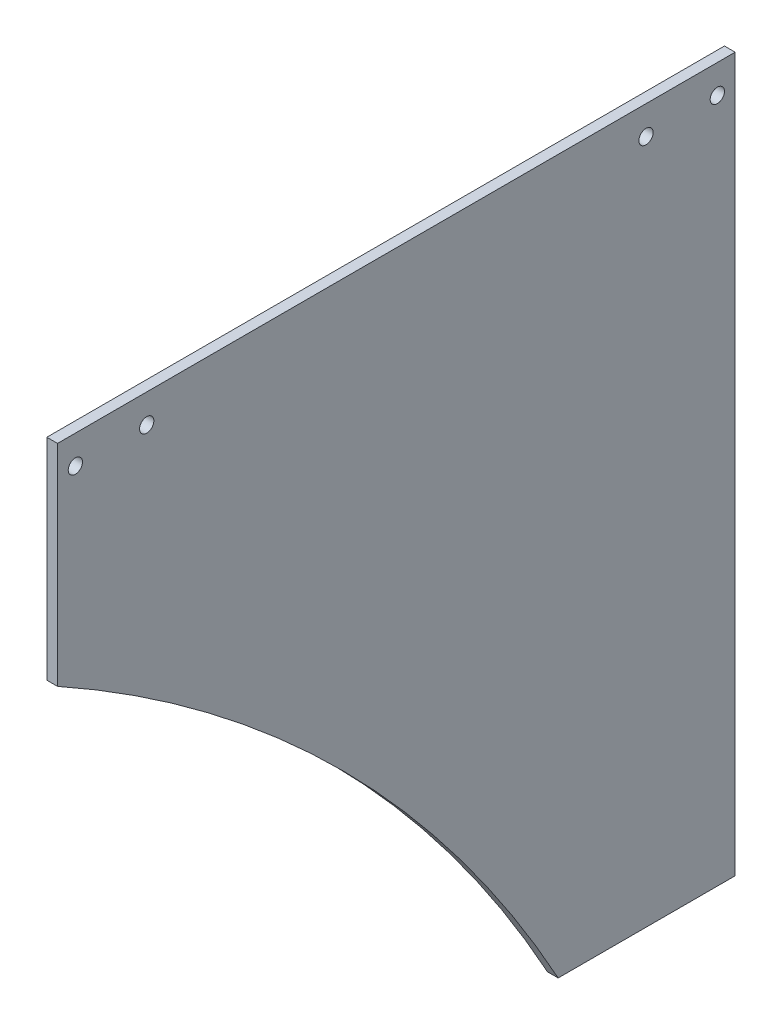
ISO-10303-21;
HEADER;
FILE_DESCRIPTION(('STEP AP214'),'2;1');
FILE_NAME('part.step','',(''),(''),'','','');
FILE_SCHEMA(('AUTOMOTIVE_DESIGN { 1 0 10303 214 1 1 1 1 }'));
ENDSEC;
DATA;
#1=APPLICATION_CONTEXT('core data for automotive mechanical design processes');
#2=APPLICATION_PROTOCOL_DEFINITION('international standard','automotive_design',2000,#1);
#3=PRODUCT_CONTEXT('',#1,'mechanical');
#4=PRODUCT('Part','Part','',(#3));
#5=PRODUCT_RELATED_PRODUCT_CATEGORY('part','',(#4));
#6=PRODUCT_DEFINITION_FORMATION('','',#4);
#7=PRODUCT_DEFINITION_CONTEXT('part definition',#1,'design');
#8=PRODUCT_DEFINITION('design','',#6,#7);
#9=PRODUCT_DEFINITION_SHAPE('','',#8);
#10=(LENGTH_UNIT() NAMED_UNIT(*) SI_UNIT(.MILLI.,.METRE.));
#11=(NAMED_UNIT(*) PLANE_ANGLE_UNIT() SI_UNIT($,.RADIAN.));
#12=(NAMED_UNIT(*) SI_UNIT($,.STERADIAN.) SOLID_ANGLE_UNIT());
#13=UNCERTAINTY_MEASURE_WITH_UNIT(LENGTH_MEASURE(1.E-05),#10,'distance_accuracy_value','');
#14=(GEOMETRIC_REPRESENTATION_CONTEXT(3) GLOBAL_UNCERTAINTY_ASSIGNED_CONTEXT((#13)) GLOBAL_UNIT_ASSIGNED_CONTEXT((#10,
#11,#12)) REPRESENTATION_CONTEXT('',''));
#15=CARTESIAN_POINT('',(0.,0.,0.));
#16=DIRECTION('',(0.,0.,1.));
#17=DIRECTION('',(1.,0.,0.));
#18=AXIS2_PLACEMENT_3D('',#15,#16,#17);
#19=CARTESIAN_POINT('',(-3.,0.,0.));
#20=DIRECTION('',(0.,0.,-1.));
#21=DIRECTION('',(-1.,0.,0.));
#22=AXIS2_PLACEMENT_3D('',#19,#20,#21);
#23=PLANE('',#22);
#24=DIRECTION('',(0.,1.,0.));
#25=VECTOR('',#24,1.);
#26=CARTESIAN_POINT('',(0.,0.,0.));
#27=LINE('',#26,#25);
#28=CARTESIAN_POINT('',(0.,0.,0.));
#29=VERTEX_POINT('',#28);
#30=CARTESIAN_POINT('',(0.,200.,0.));
#31=VERTEX_POINT('',#30);
#32=EDGE_CURVE('E116',#29,#31,#27,.T.);
#33=ORIENTED_EDGE('',*,*,#32,.F.);
#34=DIRECTION('',(1.,0.,0.));
#35=VECTOR('',#34,1.);
#36=CARTESIAN_POINT('',(-3.,0.,0.));
#37=LINE('',#36,#35);
#38=CARTESIAN_POINT('',(-3.,0.,0.));
#39=VERTEX_POINT('',#38);
#40=EDGE_CURVE('E11',#39,#29,#37,.T.);
#41=ORIENTED_EDGE('',*,*,#40,.F.);
#42=DIRECTION('',(0.,1.,0.));
#43=VECTOR('',#42,1.);
#44=CARTESIAN_POINT('',(-3.,0.,0.));
#45=LINE('',#44,#43);
#46=CARTESIAN_POINT('',(-3.,200.,0.));
#47=VERTEX_POINT('',#46);
#48=EDGE_CURVE('E111',#39,#47,#45,.T.);
#49=ORIENTED_EDGE('',*,*,#48,.T.);
#50=DIRECTION('',(1.,0.,0.));
#51=VECTOR('',#50,1.);
#52=CARTESIAN_POINT('',(-3.,200.,0.));
#53=LINE('',#52,#51);
#54=EDGE_CURVE('E42',#47,#31,#53,.T.);
#55=ORIENTED_EDGE('',*,*,#54,.T.);
#56=EDGE_LOOP('',(#33,#41,#49,#55));
#57=FACE_BOUND('',#56,.T.);
#58=ADVANCED_FACE('F39',(#57),#23,.T.);
#59=CARTESIAN_POINT('',(-3.,0.,49.6239947896954));
#60=DIRECTION('',(0.,-1.,0.));
#61=DIRECTION('',(0.,0.,-1.));
#62=AXIS2_PLACEMENT_3D('',#59,#60,#61);
#63=PLANE('',#62);
#64=DIRECTION('',(0.,0.,-1.));
#65=VECTOR('',#64,1.);
#66=CARTESIAN_POINT('',(0.,0.,49.6239947896954));
#67=LINE('',#66,#65);
#68=CARTESIAN_POINT('',(0.,0.,49.6239947896954));
#69=VERTEX_POINT('',#68);
#70=EDGE_CURVE('E126',#69,#29,#67,.T.);
#71=ORIENTED_EDGE('',*,*,#70,.F.);
#72=DIRECTION('',(1.,0.,0.));
#73=VECTOR('',#72,1.);
#74=CARTESIAN_POINT('',(-3.,0.,49.6239947896954));
#75=LINE('',#74,#73);
#76=CARTESIAN_POINT('',(-3.,0.,49.6239947896954));
#77=VERTEX_POINT('',#76);
#78=EDGE_CURVE('E48',#77,#69,#75,.T.);
#79=ORIENTED_EDGE('',*,*,#78,.F.);
#80=DIRECTION('',(0.,0.,-1.));
#81=VECTOR('',#80,1.);
#82=CARTESIAN_POINT('',(-3.,0.,49.6239947896954));
#83=LINE('',#82,#81);
#84=EDGE_CURVE('E106',#77,#39,#83,.T.);
#85=ORIENTED_EDGE('',*,*,#84,.T.);
#86=ORIENTED_EDGE('',*,*,#40,.T.);
#87=EDGE_LOOP('',(#71,#79,#85,#86));
#88=FACE_BOUND('',#87,.T.);
#89=ADVANCED_FACE('F132',(#88),#63,.T.);
#90=CARTESIAN_POINT('',(-3.,-173.602924334787,365.));
#91=DIRECTION('',(1.,0.,0.));
#92=DIRECTION('',(0.,0.,-1.));
#93=AXIS2_PLACEMENT_3D('',#90,#91,#92);
#94=CYLINDRICAL_SURFACE('',#93,360.);
#95=CARTESIAN_POINT('',(0.,-173.602924334787,365.));
#96=DIRECTION('',(-1.,0.,0.));
#97=DIRECTION('',(0.,0.,-1.));
#98=AXIS2_PLACEMENT_3D('',#95,#96,#97);
#99=CIRCLE('',#98,360.);
#100=CARTESIAN_POINT('',(0.,141.,190.));
#101=VERTEX_POINT('',#100);
#102=EDGE_CURVE('E95',#101,#69,#99,.T.);
#103=ORIENTED_EDGE('',*,*,#102,.F.);
#104=DIRECTION('',(1.,0.,0.));
#105=VECTOR('',#104,1.);
#106=CARTESIAN_POINT('',(-3.,141.,190.));
#107=LINE('',#106,#105);
#108=CARTESIAN_POINT('',(-3.,141.,190.));
#109=VERTEX_POINT('',#108);
#110=EDGE_CURVE('E90',#109,#101,#107,.T.);
#111=ORIENTED_EDGE('',*,*,#110,.F.);
#112=CARTESIAN_POINT('',(-3.,-173.602924334787,365.));
#113=DIRECTION('',(-1.,0.,0.));
#114=DIRECTION('',(0.,0.,-1.));
#115=AXIS2_PLACEMENT_3D('',#112,#113,#114);
#116=CIRCLE('',#115,360.);
#117=EDGE_CURVE('E93',#109,#77,#116,.T.);
#118=ORIENTED_EDGE('',*,*,#117,.T.);
#119=ORIENTED_EDGE('',*,*,#78,.T.);
#120=EDGE_LOOP('',(#103,#111,#118,#119));
#121=FACE_BOUND('',#120,.T.);
#122=ADVANCED_FACE('F92',(#121),#94,.F.);
#123=CARTESIAN_POINT('',(-3.,141.,190.));
#124=DIRECTION('',(0.,0.,1.));
#125=DIRECTION('',(1.,0.,0.));
#126=AXIS2_PLACEMENT_3D('',#123,#124,#125);
#127=PLANE('',#126);
#128=DIRECTION('',(0.,-1.,0.));
#129=VECTOR('',#128,1.);
#130=CARTESIAN_POINT('',(0.,141.,190.));
#131=LINE('',#130,#129);
#132=CARTESIAN_POINT('',(0.,200.,190.));
#133=VERTEX_POINT('',#132);
#134=EDGE_CURVE('E123',#133,#101,#131,.T.);
#135=ORIENTED_EDGE('',*,*,#134,.F.);
#136=DIRECTION('',(1.,0.,0.));
#137=VECTOR('',#136,1.);
#138=CARTESIAN_POINT('',(-3.,200.,190.));
#139=LINE('',#138,#137);
#140=CARTESIAN_POINT('',(-3.,200.,190.));
#141=VERTEX_POINT('',#140);
#142=EDGE_CURVE('E100',#141,#133,#139,.T.);
#143=ORIENTED_EDGE('',*,*,#142,.F.);
#144=DIRECTION('',(0.,-1.,0.));
#145=VECTOR('',#144,1.);
#146=CARTESIAN_POINT('',(-3.,141.,190.));
#147=LINE('',#146,#145);
#148=EDGE_CURVE('E105',#141,#109,#147,.T.);
#149=ORIENTED_EDGE('',*,*,#148,.T.);
#150=ORIENTED_EDGE('',*,*,#110,.T.);
#151=EDGE_LOOP('',(#135,#143,#149,#150));
#152=FACE_BOUND('',#151,.T.);
#153=ADVANCED_FACE('F108',(#152),#127,.T.);
#154=CARTESIAN_POINT('',(-3.,200.,190.));
#155=DIRECTION('',(0.,1.,0.));
#156=DIRECTION('',(0.,0.,1.));
#157=AXIS2_PLACEMENT_3D('',#154,#155,#156);
#158=PLANE('',#157);
#159=DIRECTION('',(0.,0.,1.));
#160=VECTOR('',#159,1.);
#161=CARTESIAN_POINT('',(0.,200.,190.));
#162=LINE('',#161,#160);
#163=EDGE_CURVE('E119',#31,#133,#162,.T.);
#164=ORIENTED_EDGE('',*,*,#163,.F.);
#165=ORIENTED_EDGE('',*,*,#54,.F.);
#166=DIRECTION('',(0.,0.,1.));
#167=VECTOR('',#166,1.);
#168=CARTESIAN_POINT('',(-3.,200.,190.));
#169=LINE('',#168,#167);
#170=EDGE_CURVE('E109',#47,#141,#169,.T.);
#171=ORIENTED_EDGE('',*,*,#170,.T.);
#172=ORIENTED_EDGE('',*,*,#142,.T.);
#173=EDGE_LOOP('',(#164,#165,#171,#172));
#174=FACE_BOUND('',#173,.T.);
#175=ADVANCED_FACE('F129',(#174),#158,.T.);
#176=CARTESIAN_POINT('',(-3.,-173.602924334787,365.));
#177=DIRECTION('',(1.,0.,0.));
#178=DIRECTION('',(0.,0.,-1.));
#179=AXIS2_PLACEMENT_3D('',#176,#177,#178);
#180=PLANE('',#179);
#181=CARTESIAN_POINT('',(-3.,192.,5.));
#182=DIRECTION('',(1.,0.,0.));
#183=DIRECTION('',(0.,0.,-1.));
#184=AXIS2_PLACEMENT_3D('',#181,#182,#183);
#185=CIRCLE('',#184,2.);
#186=CARTESIAN_POINT('',(-3.,192.,3.));
#187=VERTEX_POINT('',#186);
#188=EDGE_CURVE('E175',#187,#187,#185,.T.);
#189=ORIENTED_EDGE('',*,*,#188,.T.);
#190=EDGE_LOOP('',(#189));
#191=FACE_BOUND('',#190,.T.);
#192=CARTESIAN_POINT('',(-3.,192.,25.));
#193=DIRECTION('',(1.,0.,0.));
#194=DIRECTION('',(0.,0.,-1.));
#195=AXIS2_PLACEMENT_3D('',#192,#193,#194);
#196=CIRCLE('',#195,2.);
#197=CARTESIAN_POINT('',(-3.,192.,23.));
#198=VERTEX_POINT('',#197);
#199=EDGE_CURVE('E183',#198,#198,#196,.T.);
#200=ORIENTED_EDGE('',*,*,#199,.T.);
#201=EDGE_LOOP('',(#200));
#202=FACE_BOUND('',#201,.T.);
#203=CARTESIAN_POINT('',(-3.,192.,165.));
#204=DIRECTION('',(1.,0.,0.));
#205=DIRECTION('',(0.,0.,-1.));
#206=AXIS2_PLACEMENT_3D('',#203,#204,#205);
#207=CIRCLE('',#206,2.);
#208=CARTESIAN_POINT('',(-3.,192.,163.));
#209=VERTEX_POINT('',#208);
#210=EDGE_CURVE('E189',#209,#209,#207,.T.);
#211=ORIENTED_EDGE('',*,*,#210,.T.);
#212=EDGE_LOOP('',(#211));
#213=FACE_BOUND('',#212,.T.);
#214=CARTESIAN_POINT('',(-3.,192.,185.));
#215=DIRECTION('',(1.,0.,0.));
#216=DIRECTION('',(0.,0.,-1.));
#217=AXIS2_PLACEMENT_3D('',#214,#215,#216);
#218=CIRCLE('',#217,2.);
#219=CARTESIAN_POINT('',(-3.,192.,183.));
#220=VERTEX_POINT('',#219);
#221=EDGE_CURVE('E120',#220,#220,#218,.T.);
#222=ORIENTED_EDGE('',*,*,#221,.T.);
#223=EDGE_LOOP('',(#222));
#224=FACE_BOUND('',#223,.T.);
#225=ORIENTED_EDGE('',*,*,#48,.F.);
#226=ORIENTED_EDGE('',*,*,#84,.F.);
#227=ORIENTED_EDGE('',*,*,#117,.F.);
#228=ORIENTED_EDGE('',*,*,#148,.F.);
#229=ORIENTED_EDGE('',*,*,#170,.F.);
#230=EDGE_LOOP('',(#225,#226,#227,#228,#229));
#231=FACE_BOUND('',#230,.T.);
#232=ADVANCED_FACE('F104',(#191,#202,#213,#224,#231),#180,.F.);
#233=CARTESIAN_POINT('',(0.,-173.602924334787,365.));
#234=DIRECTION('',(1.,0.,0.));
#235=DIRECTION('',(0.,0.,-1.));
#236=AXIS2_PLACEMENT_3D('',#233,#234,#235);
#237=PLANE('',#236);
#238=CARTESIAN_POINT('',(0.,192.,5.));
#239=DIRECTION('',(1.,0.,0.));
#240=DIRECTION('',(0.,0.,-1.));
#241=AXIS2_PLACEMENT_3D('',#238,#239,#240);
#242=CIRCLE('',#241,2.);
#243=CARTESIAN_POINT('',(0.,192.,3.));
#244=VERTEX_POINT('',#243);
#245=EDGE_CURVE('E178',#244,#244,#242,.T.);
#246=ORIENTED_EDGE('',*,*,#245,.F.);
#247=EDGE_LOOP('',(#246));
#248=FACE_BOUND('',#247,.T.);
#249=CARTESIAN_POINT('',(0.,192.,25.));
#250=DIRECTION('',(1.,0.,0.));
#251=DIRECTION('',(0.,0.,-1.));
#252=AXIS2_PLACEMENT_3D('',#249,#250,#251);
#253=CIRCLE('',#252,2.);
#254=CARTESIAN_POINT('',(0.,192.,23.));
#255=VERTEX_POINT('',#254);
#256=EDGE_CURVE('E180',#255,#255,#253,.T.);
#257=ORIENTED_EDGE('',*,*,#256,.F.);
#258=EDGE_LOOP('',(#257));
#259=FACE_BOUND('',#258,.T.);
#260=CARTESIAN_POINT('',(0.,192.,165.));
#261=DIRECTION('',(1.,0.,0.));
#262=DIRECTION('',(0.,0.,-1.));
#263=AXIS2_PLACEMENT_3D('',#260,#261,#262);
#264=CIRCLE('',#263,2.);
#265=CARTESIAN_POINT('',(0.,192.,163.));
#266=VERTEX_POINT('',#265);
#267=EDGE_CURVE('E186',#266,#266,#264,.T.);
#268=ORIENTED_EDGE('',*,*,#267,.F.);
#269=EDGE_LOOP('',(#268));
#270=FACE_BOUND('',#269,.T.);
#271=CARTESIAN_POINT('',(0.,192.,185.));
#272=DIRECTION('',(1.,0.,0.));
#273=DIRECTION('',(0.,0.,-1.));
#274=AXIS2_PLACEMENT_3D('',#271,#272,#273);
#275=CIRCLE('',#274,2.);
#276=CARTESIAN_POINT('',(0.,192.,183.));
#277=VERTEX_POINT('',#276);
#278=EDGE_CURVE('E192',#277,#277,#275,.T.);
#279=ORIENTED_EDGE('',*,*,#278,.F.);
#280=EDGE_LOOP('',(#279));
#281=FACE_BOUND('',#280,.T.);
#282=ORIENTED_EDGE('',*,*,#32,.T.);
#283=ORIENTED_EDGE('',*,*,#163,.T.);
#284=ORIENTED_EDGE('',*,*,#134,.T.);
#285=ORIENTED_EDGE('',*,*,#102,.T.);
#286=ORIENTED_EDGE('',*,*,#70,.T.);
#287=EDGE_LOOP('',(#282,#283,#284,#285,#286));
#288=FACE_BOUND('',#287,.T.);
#289=ADVANCED_FACE('F131',(#248,#259,#270,#281,#288),#237,.T.);
#290=CARTESIAN_POINT('',(-3.,192.,185.));
#291=DIRECTION('',(1.,0.,0.));
#292=DIRECTION('',(0.,0.,-1.));
#293=AXIS2_PLACEMENT_3D('',#290,#291,#292);
#294=CYLINDRICAL_SURFACE('',#293,2.);
#295=ORIENTED_EDGE('',*,*,#221,.F.);
#296=EDGE_LOOP('',(#295));
#297=FACE_BOUND('',#296,.T.);
#298=ORIENTED_EDGE('',*,*,#278,.T.);
#299=EDGE_LOOP('',(#298));
#300=FACE_BOUND('',#299,.T.);
#301=ADVANCED_FACE('F152',(#297,#300),#294,.F.);
#302=CARTESIAN_POINT('',(-3.,192.,165.));
#303=DIRECTION('',(1.,0.,0.));
#304=DIRECTION('',(0.,0.,-1.));
#305=AXIS2_PLACEMENT_3D('',#302,#303,#304);
#306=CYLINDRICAL_SURFACE('',#305,2.);
#307=ORIENTED_EDGE('',*,*,#210,.F.);
#308=EDGE_LOOP('',(#307));
#309=FACE_BOUND('',#308,.T.);
#310=ORIENTED_EDGE('',*,*,#267,.T.);
#311=EDGE_LOOP('',(#310));
#312=FACE_BOUND('',#311,.T.);
#313=ADVANCED_FACE('F159',(#309,#312),#306,.F.);
#314=CARTESIAN_POINT('',(-3.,192.,25.));
#315=DIRECTION('',(1.,0.,0.));
#316=DIRECTION('',(0.,0.,-1.));
#317=AXIS2_PLACEMENT_3D('',#314,#315,#316);
#318=CYLINDRICAL_SURFACE('',#317,2.);
#319=ORIENTED_EDGE('',*,*,#199,.F.);
#320=EDGE_LOOP('',(#319));
#321=FACE_BOUND('',#320,.T.);
#322=ORIENTED_EDGE('',*,*,#256,.T.);
#323=EDGE_LOOP('',(#322));
#324=FACE_BOUND('',#323,.T.);
#325=ADVANCED_FACE('F163',(#321,#324),#318,.F.);
#326=CARTESIAN_POINT('',(-3.,192.,5.));
#327=DIRECTION('',(1.,0.,0.));
#328=DIRECTION('',(0.,0.,-1.));
#329=AXIS2_PLACEMENT_3D('',#326,#327,#328);
#330=CYLINDRICAL_SURFACE('',#329,2.);
#331=ORIENTED_EDGE('',*,*,#188,.F.);
#332=EDGE_LOOP('',(#331));
#333=FACE_BOUND('',#332,.T.);
#334=ORIENTED_EDGE('',*,*,#245,.T.);
#335=EDGE_LOOP('',(#334));
#336=FACE_BOUND('',#335,.T.);
#337=ADVANCED_FACE('F167',(#333,#336),#330,.F.);
#338=CLOSED_SHELL('',(#58,#89,#122,#153,#175,#232,#289,#301,#313,#325,#337));
#339=MANIFOLD_SOLID_BREP('B2',#338);
#340=ADVANCED_BREP_SHAPE_REPRESENTATION('',(#18,#339),#14);
#341=SHAPE_DEFINITION_REPRESENTATION(#9,#340);
ENDSEC;
END-ISO-10303-21;
